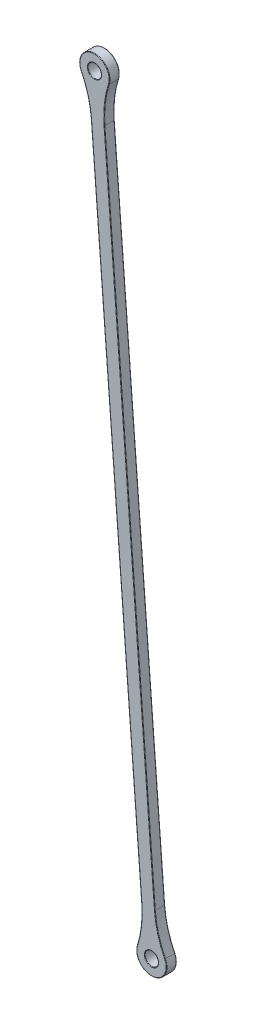
ISO-10303-21;
HEADER;
FILE_DESCRIPTION(('STEP AP214'),'2;1');
FILE_NAME('part.step','',(''),(''),'','','');
FILE_SCHEMA(('AUTOMOTIVE_DESIGN { 1 0 10303 214 1 1 1 1 }'));
ENDSEC;
DATA;
#1=APPLICATION_CONTEXT('core data for automotive mechanical design processes');
#2=APPLICATION_PROTOCOL_DEFINITION('international standard','automotive_design',2000,#1);
#3=PRODUCT_CONTEXT('',#1,'mechanical');
#4=PRODUCT('Part','Part','',(#3));
#5=PRODUCT_RELATED_PRODUCT_CATEGORY('part','',(#4));
#6=PRODUCT_DEFINITION_FORMATION('','',#4);
#7=PRODUCT_DEFINITION_CONTEXT('part definition',#1,'design');
#8=PRODUCT_DEFINITION('design','',#6,#7);
#9=PRODUCT_DEFINITION_SHAPE('','',#8);
#10=(LENGTH_UNIT() NAMED_UNIT(*) SI_UNIT(.MILLI.,.METRE.));
#11=(NAMED_UNIT(*) PLANE_ANGLE_UNIT() SI_UNIT($,.RADIAN.));
#12=(NAMED_UNIT(*) SI_UNIT($,.STERADIAN.) SOLID_ANGLE_UNIT());
#13=UNCERTAINTY_MEASURE_WITH_UNIT(LENGTH_MEASURE(1.E-05),#10,'distance_accuracy_value','');
#14=(GEOMETRIC_REPRESENTATION_CONTEXT(3) GLOBAL_UNCERTAINTY_ASSIGNED_CONTEXT((#13)) GLOBAL_UNIT_ASSIGNED_CONTEXT((#10,
#11,#12)) REPRESENTATION_CONTEXT('',''));
#15=CARTESIAN_POINT('',(0.,0.,0.));
#16=DIRECTION('',(0.,0.,1.));
#17=DIRECTION('',(1.,0.,0.));
#18=AXIS2_PLACEMENT_3D('',#15,#16,#17);
#19=CARTESIAN_POINT('',(22.6475823836566,1.74399123036091,-3.));
#20=DIRECTION('',(-0.99704818829738,-0.0767783186382262,0.));
#21=DIRECTION('',(0.0767783186382262,-0.99704818829738,0.));
#22=AXIS2_PLACEMENT_3D('',#19,#20,#21);
#23=PLANE('',#22);
#24=DIRECTION('',(0.,0.,-1.));
#25=VECTOR('',#24,1.);
#26=CARTESIAN_POINT('',(15.5041323252794,94.5092935347507,-3.));
#27=LINE('',#26,#25);
#28=CARTESIAN_POINT('',(15.5041323252794,94.5092935347507,-0.15));
#29=VERTEX_POINT('',#28);
#30=CARTESIAN_POINT('',(15.5041323252794,94.5092935347507,-2.85));
#31=VERTEX_POINT('',#30);
#32=EDGE_CURVE('E310',#29,#31,#27,.T.);
#33=ORIENTED_EDGE('',*,*,#32,.T.);
#34=DIRECTION('',(0.0767783186382262,-0.99704818829738,0.));
#35=VECTOR('',#34,1.);
#36=CARTESIAN_POINT('',(22.6475823836566,1.74399123036091,-2.85));
#37=LINE('',#36,#35);
#38=CARTESIAN_POINT('',(0.439273690223931,290.142517541819,-2.85));
#39=VERTEX_POINT('',#38);
#40=EDGE_CURVE('E219',#31,#39,#37,.F.);
#41=ORIENTED_EDGE('',*,*,#40,.T.);
#42=DIRECTION('',(0.,0.,1.));
#43=VECTOR('',#42,1.);
#44=CARTESIAN_POINT('',(0.439273690223931,290.142517541819,-3.));
#45=LINE('',#44,#43);
#46=CARTESIAN_POINT('',(0.439273690223931,290.142517541819,-0.15));
#47=VERTEX_POINT('',#46);
#48=EDGE_CURVE('E346',#39,#47,#45,.T.);
#49=ORIENTED_EDGE('',*,*,#48,.T.);
#50=DIRECTION('',(0.0767783186382262,-0.99704818829738,0.));
#51=VECTOR('',#50,1.);
#52=CARTESIAN_POINT('',(15.5041323252794,94.5092935347507,-0.15));
#53=LINE('',#52,#51);
#54=EDGE_CURVE('E217',#47,#29,#53,.T.);
#55=ORIENTED_EDGE('',*,*,#54,.T.);
#56=EDGE_LOOP('',(#33,#41,#49,#55));
#57=FACE_BOUND('',#56,.T.);
#58=ADVANCED_FACE('F39',(#57),#23,.F.);
#59=CARTESIAN_POINT('',(14.5,81.4999999999992,-3.));
#60=DIRECTION('',(0.,0.,1.));
#61=DIRECTION('',(1.,0.,0.));
#62=AXIS2_PLACEMENT_3D('',#59,#60,#61);
#63=CYLINDRICAL_SURFACE('',#62,4.50000000000001);
#64=DIRECTION('',(0.,0.,1.));
#65=VECTOR('',#64,1.);
#66=CARTESIAN_POINT('',(10.2092818160654,82.8563692218755,-3.));
#67=LINE('',#66,#65);
#68=CARTESIAN_POINT('',(10.2092818160654,82.8563692218755,-0.15));
#69=VERTEX_POINT('',#68);
#70=CARTESIAN_POINT('',(10.2092818160654,82.8563692218755,-2.85));
#71=VERTEX_POINT('',#70);
#72=EDGE_CURVE('E343',#69,#71,#67,.F.);
#73=ORIENTED_EDGE('',*,*,#72,.T.);
#74=CARTESIAN_POINT('',(14.5,81.4999999999992,-2.85));
#75=DIRECTION('',(0.,0.,1.));
#76=DIRECTION('',(1.,0.,0.));
#77=AXIS2_PLACEMENT_3D('',#74,#75,#76);
#78=CIRCLE('',#77,4.50000000000001);
#79=CARTESIAN_POINT('',(18.532466692287,83.4973012731163,-2.85));
#80=VERTEX_POINT('',#79);
#81=EDGE_CURVE('E210',#71,#80,#78,.T.);
#82=ORIENTED_EDGE('',*,*,#81,.T.);
#83=DIRECTION('',(0.,0.,1.));
#84=VECTOR('',#83,1.);
#85=CARTESIAN_POINT('',(18.532466692287,83.4973012731163,-3.));
#86=LINE('',#85,#84);
#87=CARTESIAN_POINT('',(18.532466692287,83.4973012731163,-0.15));
#88=VERTEX_POINT('',#87);
#89=EDGE_CURVE('E338',#80,#88,#86,.T.);
#90=ORIENTED_EDGE('',*,*,#89,.T.);
#91=CARTESIAN_POINT('',(14.5,81.4999999999992,-0.15));
#92=DIRECTION('',(0.,0.,1.));
#93=DIRECTION('',(1.,0.,0.));
#94=AXIS2_PLACEMENT_3D('',#91,#92,#93);
#95=CIRCLE('',#94,4.50000000000001);
#96=EDGE_CURVE('E208',#88,#69,#95,.F.);
#97=ORIENTED_EDGE('',*,*,#96,.T.);
#98=EDGE_LOOP('',(#73,#82,#90,#97));
#99=FACE_BOUND('',#98,.T.);
#100=ADVANCED_FACE('F388',(#99),#63,.T.);
#101=CARTESIAN_POINT('',(18.659389630467,1.436877955808,-3.));
#102=DIRECTION('',(-0.99704818829738,-0.0767783186382261,0.));
#103=DIRECTION('',(0.0767783186382261,-0.99704818829738,0.));
#104=AXIS2_PLACEMENT_3D('',#101,#102,#103);
#105=PLANE('',#104);
#106=DIRECTION('',(0.,0.,-1.));
#107=VECTOR('',#106,1.);
#108=CARTESIAN_POINT('',(-3.54891906296558,289.835404267266,-3.));
#109=LINE('',#108,#107);
#110=CARTESIAN_POINT('',(-3.54891906296558,289.835404267266,-0.15));
#111=VERTEX_POINT('',#110);
#112=CARTESIAN_POINT('',(-3.54891906296558,289.835404267266,-2.85));
#113=VERTEX_POINT('',#112);
#114=EDGE_CURVE('E262',#111,#113,#109,.T.);
#115=ORIENTED_EDGE('',*,*,#114,.T.);
#116=DIRECTION('',(0.0767783186382261,-0.99704818829738,0.));
#117=VECTOR('',#116,1.);
#118=CARTESIAN_POINT('',(11.5159395720898,94.202180260198,-2.85));
#119=LINE('',#118,#117);
#120=CARTESIAN_POINT('',(11.5159395720898,94.202180260198,-2.85));
#121=VERTEX_POINT('',#120);
#122=EDGE_CURVE('E202',#113,#121,#119,.T.);
#123=ORIENTED_EDGE('',*,*,#122,.T.);
#124=DIRECTION('',(0.,0.,1.));
#125=VECTOR('',#124,1.);
#126=CARTESIAN_POINT('',(11.5159395720898,94.202180260198,-3.));
#127=LINE('',#126,#125);
#128=CARTESIAN_POINT('',(11.5159395720898,94.202180260198,-0.15));
#129=VERTEX_POINT('',#128);
#130=EDGE_CURVE('E336',#121,#129,#127,.T.);
#131=ORIENTED_EDGE('',*,*,#130,.T.);
#132=DIRECTION('',(0.0767783186382261,-0.99704818829738,0.));
#133=VECTOR('',#132,1.);
#134=CARTESIAN_POINT('',(18.659389630467,1.436877955808,-0.15));
#135=LINE('',#134,#133);
#136=EDGE_CURVE('E200',#129,#111,#135,.F.);
#137=ORIENTED_EDGE('',*,*,#136,.T.);
#138=EDGE_LOOP('',(#115,#123,#131,#137));
#139=FACE_BOUND('',#138,.T.);
#140=ADVANCED_FACE('F335',(#139),#105,.T.);
#141=CARTESIAN_POINT('',(14.5,81.4999999999992,-3.));
#142=DIRECTION('',(0.,0.,1.));
#143=DIRECTION('',(1.,0.,0.));
#144=AXIS2_PLACEMENT_3D('',#141,#142,#143);
#145=CYLINDRICAL_SURFACE('',#144,2.00000000000001);
#146=CARTESIAN_POINT('',(14.5,81.4999999999992,-2.85));
#147=DIRECTION('',(0.,0.,1.));
#148=DIRECTION('',(1.,0.,0.));
#149=AXIS2_PLACEMENT_3D('',#146,#147,#148);
#150=CIRCLE('',#149,2.00000000000001);
#151=CARTESIAN_POINT('',(16.5,81.4999999999992,-2.85));
#152=VERTEX_POINT('',#151);
#153=EDGE_CURVE('E194',#152,#152,#150,.F.);
#154=ORIENTED_EDGE('',*,*,#153,.T.);
#155=EDGE_LOOP('',(#154));
#156=FACE_BOUND('',#155,.T.);
#157=CARTESIAN_POINT('',(14.5,81.4999999999992,-0.15));
#158=DIRECTION('',(0.,0.,1.));
#159=DIRECTION('',(1.,0.,0.));
#160=AXIS2_PLACEMENT_3D('',#157,#158,#159);
#161=CIRCLE('',#160,2.00000000000001);
#162=CARTESIAN_POINT('',(16.5,81.4999999999992,-0.15));
#163=VERTEX_POINT('',#162);
#164=EDGE_CURVE('E191',#163,#163,#161,.T.);
#165=ORIENTED_EDGE('',*,*,#164,.T.);
#166=EDGE_LOOP('',(#165));
#167=FACE_BOUND('',#166,.T.);
#168=ADVANCED_FACE('F640',(#156,#167),#145,.F.);
#169=CARTESIAN_POINT('',(-2.54478673768622,302.844697802017,-3.));
#170=DIRECTION('',(0.,0.,1.));
#171=DIRECTION('',(1.,0.,0.));
#172=AXIS2_PLACEMENT_3D('',#169,#170,#171);
#173=CYLINDRICAL_SURFACE('',#172,4.5);
#174=DIRECTION('',(0.,0.,1.));
#175=VECTOR('',#174,1.);
#176=CARTESIAN_POINT('',(1.74593144624834,301.488328580141,-3.));
#177=LINE('',#176,#175);
#178=CARTESIAN_POINT('',(1.74593144624834,301.488328580141,-0.15));
#179=VERTEX_POINT('',#178);
#180=CARTESIAN_POINT('',(1.74593144624834,301.488328580141,-2.85));
#181=VERTEX_POINT('',#180);
#182=EDGE_CURVE('E306',#179,#181,#177,.F.);
#183=ORIENTED_EDGE('',*,*,#182,.T.);
#184=CARTESIAN_POINT('',(-2.54478673768622,302.844697802017,-2.85));
#185=DIRECTION('',(0.,0.,1.));
#186=DIRECTION('',(1.,0.,0.));
#187=AXIS2_PLACEMENT_3D('',#184,#185,#186);
#188=CIRCLE('',#187,4.5);
#189=CARTESIAN_POINT('',(-6.57725342997327,300.8473965289,-2.85));
#190=VERTEX_POINT('',#189);
#191=EDGE_CURVE('E227',#181,#190,#188,.T.);
#192=ORIENTED_EDGE('',*,*,#191,.T.);
#193=DIRECTION('',(0.,0.,1.));
#194=VECTOR('',#193,1.);
#195=CARTESIAN_POINT('',(-6.57725342997327,300.8473965289,-3.));
#196=LINE('',#195,#194);
#197=CARTESIAN_POINT('',(-6.57725342997327,300.8473965289,-0.15));
#198=VERTEX_POINT('',#197);
#199=EDGE_CURVE('E299',#190,#198,#196,.T.);
#200=ORIENTED_EDGE('',*,*,#199,.T.);
#201=CARTESIAN_POINT('',(-2.54478673768622,302.844697802017,-0.15));
#202=DIRECTION('',(0.,0.,1.));
#203=DIRECTION('',(1.,0.,0.));
#204=AXIS2_PLACEMENT_3D('',#201,#202,#203);
#205=CIRCLE('',#204,4.5);
#206=EDGE_CURVE('E225',#198,#179,#205,.F.);
#207=ORIENTED_EDGE('',*,*,#206,.T.);
#208=EDGE_LOOP('',(#183,#192,#200,#207));
#209=FACE_BOUND('',#208,.T.);
#210=ADVANCED_FACE('F303',(#209),#173,.T.);
#211=CARTESIAN_POINT('',(-2.54478673768622,302.844697802017,-3.));
#212=DIRECTION('',(0.,0.,1.));
#213=DIRECTION('',(1.,0.,0.));
#214=AXIS2_PLACEMENT_3D('',#211,#212,#213);
#215=CYLINDRICAL_SURFACE('',#214,2.);
#216=CARTESIAN_POINT('',(-2.54478673768622,302.844697802017,-2.85));
#217=DIRECTION('',(0.,0.,1.));
#218=DIRECTION('',(1.,0.,0.));
#219=AXIS2_PLACEMENT_3D('',#216,#217,#218);
#220=CIRCLE('',#219,2.);
#221=CARTESIAN_POINT('',(-0.544786737686224,302.844697802017,-2.85));
#222=VERTEX_POINT('',#221);
#223=EDGE_CURVE('E174',#222,#222,#220,.F.);
#224=ORIENTED_EDGE('',*,*,#223,.T.);
#225=EDGE_LOOP('',(#224));
#226=FACE_BOUND('',#225,.T.);
#227=CARTESIAN_POINT('',(-2.54478673768622,302.844697802017,-0.15));
#228=DIRECTION('',(0.,0.,1.));
#229=DIRECTION('',(1.,0.,0.));
#230=AXIS2_PLACEMENT_3D('',#227,#228,#229);
#231=CIRCLE('',#230,2.);
#232=CARTESIAN_POINT('',(-0.544786737686224,302.844697802017,-0.15));
#233=VERTEX_POINT('',#232);
#234=EDGE_CURVE('E305',#233,#233,#231,.T.);
#235=ORIENTED_EDGE('',*,*,#234,.T.);
#236=EDGE_LOOP('',(#235));
#237=FACE_BOUND('',#236,.T.);
#238=ADVANCED_FACE('F618',(#226,#237),#215,.F.);
#239=CARTESIAN_POINT('',(0.,0.,-3.));
#240=DIRECTION('',(0.,0.,1.));
#241=DIRECTION('',(1.,0.,0.));
#242=AXIS2_PLACEMENT_3D('',#239,#240,#241);
#243=PLANE('',#242);
#244=CARTESIAN_POINT('',(-2.54478673768622,302.844697802017,-3.));
#245=DIRECTION('',(0.,0.,1.));
#246=DIRECTION('',(1.,0.,0.));
#247=AXIS2_PLACEMENT_3D('',#244,#245,#246);
#248=CIRCLE('',#247,2.15);
#249=CARTESIAN_POINT('',(-0.394786737686224,302.844697802017,-3.));
#250=VERTEX_POINT('',#249);
#251=EDGE_CURVE('E183',#250,#250,#248,.T.);
#252=ORIENTED_EDGE('',*,*,#251,.T.);
#253=EDGE_LOOP('',(#252));
#254=FACE_BOUND('',#253,.T.);
#255=CARTESIAN_POINT('',(14.5,81.4999999999992,-3.));
#256=DIRECTION('',(0.,0.,1.));
#257=DIRECTION('',(1.,0.,0.));
#258=AXIS2_PLACEMENT_3D('',#255,#256,#257);
#259=CIRCLE('',#258,2.15000000000001);
#260=CARTESIAN_POINT('',(16.65,81.4999999999992,-3.));
#261=VERTEX_POINT('',#260);
#262=EDGE_CURVE('E180',#261,#261,#259,.T.);
#263=ORIENTED_EDGE('',*,*,#262,.T.);
#264=EDGE_LOOP('',(#263));
#265=FACE_BOUND('',#264,.T.);
#266=DIRECTION('',(0.0767783186382261,-0.99704818829738,0.));
#267=VECTOR('',#266,1.);
#268=CARTESIAN_POINT('',(-3.39936183472098,289.846921015062,-3.));
#269=LINE('',#268,#267);
#270=CARTESIAN_POINT('',(11.6654968003344,94.2136970079937,-3.));
#271=VERTEX_POINT('',#270);
#272=CARTESIAN_POINT('',(-3.39936183472098,289.846921015062,-3.));
#273=VERTEX_POINT('',#272);
#274=EDGE_CURVE('E178',#271,#273,#269,.F.);
#275=ORIENTED_EDGE('',*,*,#274,.T.);
#276=CARTESIAN_POINT('',(-33.460364711887,287.532054708119,-3.));
#277=DIRECTION('',(0.,0.,1.));
#278=DIRECTION('',(1.,0.,0.));
#279=AXIS2_PLACEMENT_3D('',#276,#277,#278);
#280=CIRCLE('',#279,30.15);
#281=CARTESIAN_POINT('',(-6.44283787356371,300.913973238004,-3.));
#282=VERTEX_POINT('',#281);
#283=EDGE_CURVE('E159',#273,#282,#280,.T.);
#284=ORIENTED_EDGE('',*,*,#283,.T.);
#285=CARTESIAN_POINT('',(-2.54478673768622,302.844697802017,-3.));
#286=DIRECTION('',(0.,0.,1.));
#287=DIRECTION('',(1.,0.,0.));
#288=AXIS2_PLACEMENT_3D('',#285,#286,#287);
#289=CIRCLE('',#288,4.35);
#290=CARTESIAN_POINT('',(1.60290750678386,301.533540887537,-3.));
#291=VERTEX_POINT('',#290);
#292=EDGE_CURVE('E167',#282,#291,#289,.F.);
#293=ORIENTED_EDGE('',*,*,#292,.T.);
#294=CARTESIAN_POINT('',(30.3507193391453,292.445867100966,-3.));
#295=DIRECTION('',(0.,0.,1.));
#296=DIRECTION('',(1.,0.,0.));
#297=AXIS2_PLACEMENT_3D('',#294,#295,#296);
#298=CIRCLE('',#297,30.15);
#299=CARTESIAN_POINT('',(0.289716461979317,290.131000794023,-3.));
#300=VERTEX_POINT('',#299);
#301=EDGE_CURVE('E173',#291,#300,#298,.T.);
#302=ORIENTED_EDGE('',*,*,#301,.T.);
#303=DIRECTION('',(0.0767783186382262,-0.99704818829738,0.));
#304=VECTOR('',#303,1.);
#305=CARTESIAN_POINT('',(22.498025155412,1.73247448256518,-3.));
#306=LINE('',#305,#304);
#307=CARTESIAN_POINT('',(15.3545750970348,94.497776786955,-3.));
#308=VERTEX_POINT('',#307);
#309=EDGE_CURVE('E317',#300,#308,#306,.T.);
#310=ORIENTED_EDGE('',*,*,#309,.T.);
#311=CARTESIAN_POINT('',(45.4155779742007,96.8126430938975,-3.));
#312=DIRECTION('',(0.,0.,1.));
#313=DIRECTION('',(1.,0.,0.));
#314=AXIS2_PLACEMENT_3D('',#311,#312,#313);
#315=CIRCLE('',#314,30.15);
#316=CARTESIAN_POINT('',(18.3980511358775,83.4307245640125,-3.));
#317=VERTEX_POINT('',#316);
#318=EDGE_CURVE('E319',#308,#317,#315,.T.);
#319=ORIENTED_EDGE('',*,*,#318,.T.);
#320=CARTESIAN_POINT('',(14.5,81.4999999999992,-3.));
#321=DIRECTION('',(0.,0.,1.));
#322=DIRECTION('',(1.,0.,0.));
#323=AXIS2_PLACEMENT_3D('',#320,#321,#322);
#324=CIRCLE('',#323,4.35000000000001);
#325=CARTESIAN_POINT('',(10.3523057555299,82.8111569144797,-3.));
#326=VERTEX_POINT('',#325);
#327=EDGE_CURVE('E321',#317,#326,#324,.F.);
#328=ORIENTED_EDGE('',*,*,#327,.T.);
#329=CARTESIAN_POINT('',(-18.3955060768316,91.8988307010512,-3.));
#330=DIRECTION('',(0.,0.,1.));
#331=DIRECTION('',(1.,0.,0.));
#332=AXIS2_PLACEMENT_3D('',#329,#330,#331);
#333=CIRCLE('',#332,30.15);
#334=EDGE_CURVE('E185',#326,#271,#333,.T.);
#335=ORIENTED_EDGE('',*,*,#334,.T.);
#336=EDGE_LOOP('',(#275,#284,#293,#302,#310,#319,#328,#335));
#337=FACE_BOUND('',#336,.T.);
#338=ADVANCED_FACE('F176',(#254,#265,#337),#243,.F.);
#339=CARTESIAN_POINT('',(0.,0.,0.));
#340=DIRECTION('',(0.,0.,1.));
#341=DIRECTION('',(1.,0.,0.));
#342=AXIS2_PLACEMENT_3D('',#339,#340,#341);
#343=PLANE('',#342);
#344=CARTESIAN_POINT('',(-2.54478673768622,302.844697802017,0.));
#345=DIRECTION('',(0.,0.,1.));
#346=DIRECTION('',(1.,0.,0.));
#347=AXIS2_PLACEMENT_3D('',#344,#345,#346);
#348=CIRCLE('',#347,2.15);
#349=CARTESIAN_POINT('',(-0.394786737686224,302.844697802017,0.));
#350=VERTEX_POINT('',#349);
#351=EDGE_CURVE('E11',#350,#350,#348,.F.);
#352=ORIENTED_EDGE('',*,*,#351,.T.);
#353=EDGE_LOOP('',(#352));
#354=FACE_BOUND('',#353,.T.);
#355=CARTESIAN_POINT('',(14.5,81.4999999999992,0.));
#356=DIRECTION('',(0.,0.,1.));
#357=DIRECTION('',(1.,0.,0.));
#358=AXIS2_PLACEMENT_3D('',#355,#356,#357);
#359=CIRCLE('',#358,2.15000000000001);
#360=CARTESIAN_POINT('',(16.65,81.4999999999992,0.));
#361=VERTEX_POINT('',#360);
#362=EDGE_CURVE('E48',#361,#361,#359,.F.);
#363=ORIENTED_EDGE('',*,*,#362,.T.);
#364=EDGE_LOOP('',(#363));
#365=FACE_BOUND('',#364,.T.);
#366=CARTESIAN_POINT('',(14.5,81.4999999999992,0.));
#367=DIRECTION('',(0.,0.,1.));
#368=DIRECTION('',(1.,0.,0.));
#369=AXIS2_PLACEMENT_3D('',#366,#367,#368);
#370=CIRCLE('',#369,4.35000000000001);
#371=CARTESIAN_POINT('',(10.3523057555299,82.8111569144797,0.));
#372=VERTEX_POINT('',#371);
#373=CARTESIAN_POINT('',(18.3980511358775,83.4307245640125,0.));
#374=VERTEX_POINT('',#373);
#375=EDGE_CURVE('E56',#372,#374,#370,.T.);
#376=ORIENTED_EDGE('',*,*,#375,.T.);
#377=CARTESIAN_POINT('',(45.4155779742007,96.8126430938975,0.));
#378=DIRECTION('',(0.,0.,1.));
#379=DIRECTION('',(1.,0.,0.));
#380=AXIS2_PLACEMENT_3D('',#377,#378,#379);
#381=CIRCLE('',#380,30.15);
#382=CARTESIAN_POINT('',(15.3545750970348,94.497776786955,0.));
#383=VERTEX_POINT('',#382);
#384=EDGE_CURVE('E241',#374,#383,#381,.F.);
#385=ORIENTED_EDGE('',*,*,#384,.T.);
#386=DIRECTION('',(0.0767783186382262,-0.99704818829738,0.));
#387=VECTOR('',#386,1.);
#388=CARTESIAN_POINT('',(0.289716461979322,290.131000794023,0.));
#389=LINE('',#388,#387);
#390=CARTESIAN_POINT('',(0.28971646197933,290.131000794023,0.));
#391=VERTEX_POINT('',#390);
#392=EDGE_CURVE('E229',#383,#391,#389,.F.);
#393=ORIENTED_EDGE('',*,*,#392,.T.);
#394=CARTESIAN_POINT('',(30.3507193391453,292.445867100966,0.));
#395=DIRECTION('',(0.,0.,1.));
#396=DIRECTION('',(1.,0.,0.));
#397=AXIS2_PLACEMENT_3D('',#394,#395,#396);
#398=CIRCLE('',#397,30.15);
#399=CARTESIAN_POINT('',(1.60290750678386,301.533540887537,0.));
#400=VERTEX_POINT('',#399);
#401=EDGE_CURVE('E231',#391,#400,#398,.F.);
#402=ORIENTED_EDGE('',*,*,#401,.T.);
#403=CARTESIAN_POINT('',(-2.54478673768622,302.844697802017,0.));
#404=DIRECTION('',(0.,0.,1.));
#405=DIRECTION('',(1.,0.,0.));
#406=AXIS2_PLACEMENT_3D('',#403,#404,#405);
#407=CIRCLE('',#406,4.35);
#408=CARTESIAN_POINT('',(-6.44283787356371,300.913973238004,0.));
#409=VERTEX_POINT('',#408);
#410=EDGE_CURVE('E233',#400,#409,#407,.T.);
#411=ORIENTED_EDGE('',*,*,#410,.T.);
#412=CARTESIAN_POINT('',(-33.460364711887,287.532054708119,0.));
#413=DIRECTION('',(0.,0.,1.));
#414=DIRECTION('',(1.,0.,0.));
#415=AXIS2_PLACEMENT_3D('',#412,#413,#414);
#416=CIRCLE('',#415,30.15);
#417=CARTESIAN_POINT('',(-3.39936183472098,289.846921015062,0.));
#418=VERTEX_POINT('',#417);
#419=EDGE_CURVE('E235',#409,#418,#416,.F.);
#420=ORIENTED_EDGE('',*,*,#419,.T.);
#421=DIRECTION('',(0.0767783186382261,-0.99704818829738,0.));
#422=VECTOR('',#421,1.);
#423=CARTESIAN_POINT('',(18.8089468587116,1.44839470360373,0.));
#424=LINE('',#423,#422);
#425=CARTESIAN_POINT('',(11.6654968003344,94.2136970079937,0.));
#426=VERTEX_POINT('',#425);
#427=EDGE_CURVE('E237',#418,#426,#424,.T.);
#428=ORIENTED_EDGE('',*,*,#427,.T.);
#429=CARTESIAN_POINT('',(-18.3955060768316,91.8988307010512,0.));
#430=DIRECTION('',(0.,0.,1.));
#431=DIRECTION('',(1.,0.,0.));
#432=AXIS2_PLACEMENT_3D('',#429,#430,#431);
#433=CIRCLE('',#432,30.15);
#434=EDGE_CURVE('E61',#426,#372,#433,.F.);
#435=ORIENTED_EDGE('',*,*,#434,.T.);
#436=EDGE_LOOP('',(#376,#385,#393,#402,#411,#420,#428,#435));
#437=FACE_BOUND('',#436,.T.);
#438=ADVANCED_FACE('F414',(#354,#365,#437),#343,.T.);
#439=CARTESIAN_POINT('',(-18.3955060768316,91.8988307010512,-3.));
#440=DIRECTION('',(0.,0.,1.));
#441=DIRECTION('',(1.,0.,0.));
#442=AXIS2_PLACEMENT_3D('',#439,#440,#441);
#443=CYLINDRICAL_SURFACE('',#442,30.);
#444=ORIENTED_EDGE('',*,*,#130,.F.);
#445=CARTESIAN_POINT('',(-18.3955060768316,91.8988307010512,-2.85));
#446=DIRECTION('',(0.,0.,1.));
#447=DIRECTION('',(1.,0.,0.));
#448=AXIS2_PLACEMENT_3D('',#445,#446,#447);
#449=CIRCLE('',#448,30.);
#450=EDGE_CURVE('E206',#121,#71,#449,.F.);
#451=ORIENTED_EDGE('',*,*,#450,.T.);
#452=ORIENTED_EDGE('',*,*,#72,.F.);
#453=CARTESIAN_POINT('',(-18.3955060768316,91.8988307010512,-0.15));
#454=DIRECTION('',(0.,0.,1.));
#455=DIRECTION('',(1.,0.,0.));
#456=AXIS2_PLACEMENT_3D('',#453,#454,#455);
#457=CIRCLE('',#456,30.);
#458=EDGE_CURVE('E204',#69,#129,#457,.T.);
#459=ORIENTED_EDGE('',*,*,#458,.T.);
#460=EDGE_LOOP('',(#444,#451,#452,#459));
#461=FACE_BOUND('',#460,.T.);
#462=ADVANCED_FACE('F411',(#461),#443,.F.);
#463=CARTESIAN_POINT('',(45.4155779742007,96.8126430938975,-3.));
#464=DIRECTION('',(0.,0.,1.));
#465=DIRECTION('',(1.,0.,0.));
#466=AXIS2_PLACEMENT_3D('',#463,#464,#465);
#467=CYLINDRICAL_SURFACE('',#466,30.);
#468=ORIENTED_EDGE('',*,*,#89,.F.);
#469=CARTESIAN_POINT('',(45.4155779742007,96.8126430938975,-2.85));
#470=DIRECTION('',(0.,0.,1.));
#471=DIRECTION('',(1.,0.,0.));
#472=AXIS2_PLACEMENT_3D('',#469,#470,#471);
#473=CIRCLE('',#472,30.);
#474=EDGE_CURVE('E215',#80,#31,#473,.F.);
#475=ORIENTED_EDGE('',*,*,#474,.T.);
#476=ORIENTED_EDGE('',*,*,#32,.F.);
#477=CARTESIAN_POINT('',(45.4155779742007,96.8126430938975,-0.15));
#478=DIRECTION('',(0.,0.,1.));
#479=DIRECTION('',(1.,0.,0.));
#480=AXIS2_PLACEMENT_3D('',#477,#478,#479);
#481=CIRCLE('',#480,30.);
#482=EDGE_CURVE('E212',#29,#88,#481,.T.);
#483=ORIENTED_EDGE('',*,*,#482,.T.);
#484=EDGE_LOOP('',(#468,#475,#476,#483));
#485=FACE_BOUND('',#484,.T.);
#486=ADVANCED_FACE('F386',(#485),#467,.F.);
#487=CARTESIAN_POINT('',(-33.460364711887,287.532054708119,-3.));
#488=DIRECTION('',(0.,0.,1.));
#489=DIRECTION('',(1.,0.,0.));
#490=AXIS2_PLACEMENT_3D('',#487,#488,#489);
#491=CYLINDRICAL_SURFACE('',#490,30.);
#492=ORIENTED_EDGE('',*,*,#199,.F.);
#493=CARTESIAN_POINT('',(-33.460364711887,287.532054708119,-2.85));
#494=DIRECTION('',(0.,0.,1.));
#495=DIRECTION('',(1.,0.,0.));
#496=AXIS2_PLACEMENT_3D('',#493,#494,#495);
#497=CIRCLE('',#496,30.);
#498=EDGE_CURVE('E161',#190,#113,#497,.F.);
#499=ORIENTED_EDGE('',*,*,#498,.T.);
#500=ORIENTED_EDGE('',*,*,#114,.F.);
#501=CARTESIAN_POINT('',(-33.460364711887,287.532054708119,-0.15));
#502=DIRECTION('',(0.,0.,1.));
#503=DIRECTION('',(1.,0.,0.));
#504=AXIS2_PLACEMENT_3D('',#501,#502,#503);
#505=CIRCLE('',#504,30.);
#506=EDGE_CURVE('E197',#111,#198,#505,.T.);
#507=ORIENTED_EDGE('',*,*,#506,.T.);
#508=EDGE_LOOP('',(#492,#499,#500,#507));
#509=FACE_BOUND('',#508,.T.);
#510=ADVANCED_FACE('F298',(#509),#491,.F.);
#511=CARTESIAN_POINT('',(30.3507193391453,292.445867100966,-3.));
#512=DIRECTION('',(0.,0.,1.));
#513=DIRECTION('',(1.,0.,0.));
#514=AXIS2_PLACEMENT_3D('',#511,#512,#513);
#515=CYLINDRICAL_SURFACE('',#514,30.);
#516=ORIENTED_EDGE('',*,*,#48,.F.);
#517=CARTESIAN_POINT('',(30.3507193391453,292.445867100966,-2.85));
#518=DIRECTION('',(0.,0.,1.));
#519=DIRECTION('',(1.,0.,0.));
#520=AXIS2_PLACEMENT_3D('',#517,#518,#519);
#521=CIRCLE('',#520,30.);
#522=EDGE_CURVE('E223',#39,#181,#521,.F.);
#523=ORIENTED_EDGE('',*,*,#522,.T.);
#524=ORIENTED_EDGE('',*,*,#182,.F.);
#525=CARTESIAN_POINT('',(30.3507193391453,292.445867100966,-0.15));
#526=DIRECTION('',(0.,0.,1.));
#527=DIRECTION('',(1.,0.,0.));
#528=AXIS2_PLACEMENT_3D('',#525,#526,#527);
#529=CIRCLE('',#528,30.);
#530=EDGE_CURVE('E221',#179,#47,#529,.T.);
#531=ORIENTED_EDGE('',*,*,#530,.T.);
#532=EDGE_LOOP('',(#516,#523,#524,#531));
#533=FACE_BOUND('',#532,.T.);
#534=ADVANCED_FACE('F370',(#533),#515,.F.);
#535=CARTESIAN_POINT('',(-2.54478673768622,302.844697802017,-2.85));
#536=DIRECTION('',(0.,0.,1.));
#537=DIRECTION('',(1.,0.,0.));
#538=AXIS2_PLACEMENT_3D('',#535,#536,#537);
#539=TOROIDAL_SURFACE('',#538,2.15,0.15);
#540=ORIENTED_EDGE('',*,*,#251,.F.);
#541=EDGE_LOOP('',(#540));
#542=FACE_BOUND('',#541,.T.);
#543=ORIENTED_EDGE('',*,*,#223,.F.);
#544=EDGE_LOOP('',(#543));
#545=FACE_BOUND('',#544,.T.);
#546=ADVANCED_FACE('F422',(#542,#545),#539,.T.);
#547=CARTESIAN_POINT('',(14.5,81.4999999999992,-2.85));
#548=DIRECTION('',(0.,0.,1.));
#549=DIRECTION('',(1.,0.,0.));
#550=AXIS2_PLACEMENT_3D('',#547,#548,#549);
#551=TOROIDAL_SURFACE('',#550,2.15000000000001,0.15);
#552=ORIENTED_EDGE('',*,*,#153,.F.);
#553=EDGE_LOOP('',(#552));
#554=FACE_BOUND('',#553,.T.);
#555=ORIENTED_EDGE('',*,*,#262,.F.);
#556=EDGE_LOOP('',(#555));
#557=FACE_BOUND('',#556,.T.);
#558=ADVANCED_FACE('F400',(#554,#557),#551,.T.);
#559=CARTESIAN_POINT('',(45.4155779742007,96.8126430938975,-2.85));
#560=DIRECTION('',(0.,0.,1.));
#561=DIRECTION('',(1.,0.,0.));
#562=AXIS2_PLACEMENT_3D('',#559,#560,#561);
#563=TOROIDAL_SURFACE('',#562,30.15,0.15);
#564=CARTESIAN_POINT('',(15.3545750970347,94.497776786955,-2.85));
#565=DIRECTION('',(-0.076778318638208,0.997048188297381,0.));
#566=DIRECTION('',(-0.997048188297381,-0.076778318638208,0.));
#567=AXIS2_PLACEMENT_3D('',#564,#565,#566);
#568=CIRCLE('',#567,0.15);
#569=EDGE_CURVE('E256',#31,#308,#568,.T.);
#570=ORIENTED_EDGE('',*,*,#569,.F.);
#571=ORIENTED_EDGE('',*,*,#474,.F.);
#572=CARTESIAN_POINT('',(18.3980511358775,83.4307245640125,-2.85));
#573=DIRECTION('',(0.443844727359334,-0.896103709397143,0.));
#574=DIRECTION('',(0.896103709397143,0.443844727359334,0.));
#575=AXIS2_PLACEMENT_3D('',#572,#573,#574);
#576=CIRCLE('',#575,0.15);
#577=EDGE_CURVE('E259',#317,#80,#576,.T.);
#578=ORIENTED_EDGE('',*,*,#577,.F.);
#579=ORIENTED_EDGE('',*,*,#318,.F.);
#580=EDGE_LOOP('',(#570,#571,#578,#579));
#581=FACE_BOUND('',#580,.T.);
#582=ADVANCED_FACE('F360',(#581),#563,.T.);
#583=CARTESIAN_POINT('',(14.5,81.4999999999992,-2.85));
#584=DIRECTION('',(0.,0.,1.));
#585=DIRECTION('',(1.,0.,0.));
#586=AXIS2_PLACEMENT_3D('',#583,#584,#585);
#587=TOROIDAL_SURFACE('',#586,4.35000000000001,0.15);
#588=ORIENTED_EDGE('',*,*,#577,.T.);
#589=ORIENTED_EDGE('',*,*,#81,.F.);
#590=CARTESIAN_POINT('',(10.3523057555299,82.8111569144797,-2.85));
#591=DIRECTION('',(0.301415382639169,0.953492929763238,0.));
#592=DIRECTION('',(-0.953492929763238,0.301415382639169,0.));
#593=AXIS2_PLACEMENT_3D('',#590,#591,#592);
#594=CIRCLE('',#593,0.15);
#595=EDGE_CURVE('E253',#326,#71,#594,.T.);
#596=ORIENTED_EDGE('',*,*,#595,.F.);
#597=ORIENTED_EDGE('',*,*,#327,.F.);
#598=EDGE_LOOP('',(#588,#589,#596,#597));
#599=FACE_BOUND('',#598,.T.);
#600=ADVANCED_FACE('F392',(#599),#587,.T.);
#601=CARTESIAN_POINT('',(22.498025155412,1.73247448256518,-2.85));
#602=DIRECTION('',(0.0767783186382262,-0.99704818829738,0.));
#603=DIRECTION('',(0.99704818829738,0.0767783186382262,0.));
#604=AXIS2_PLACEMENT_3D('',#601,#602,#603);
#605=CYLINDRICAL_SURFACE('',#604,0.15);
#606=ORIENTED_EDGE('',*,*,#569,.T.);
#607=ORIENTED_EDGE('',*,*,#309,.F.);
#608=CARTESIAN_POINT('',(0.289716461979324,290.131000794023,-2.85));
#609=DIRECTION('',(-0.076778318638392,0.997048188297367,0.));
#610=DIRECTION('',(-0.997048188297367,-0.076778318638392,0.));
#611=AXIS2_PLACEMENT_3D('',#608,#609,#610);
#612=CIRCLE('',#611,0.15);
#613=EDGE_CURVE('E250',#39,#300,#612,.T.);
#614=ORIENTED_EDGE('',*,*,#613,.F.);
#615=ORIENTED_EDGE('',*,*,#40,.F.);
#616=EDGE_LOOP('',(#606,#607,#614,#615));
#617=FACE_BOUND('',#616,.T.);
#618=ADVANCED_FACE('F365',(#617),#605,.T.);
#619=CARTESIAN_POINT('',(-18.3955060768316,91.8988307010512,-2.85));
#620=DIRECTION('',(0.,0.,1.));
#621=DIRECTION('',(1.,0.,0.));
#622=AXIS2_PLACEMENT_3D('',#619,#620,#621);
#623=TOROIDAL_SURFACE('',#622,30.15,0.15);
#624=ORIENTED_EDGE('',*,*,#595,.T.);
#625=ORIENTED_EDGE('',*,*,#450,.F.);
#626=CARTESIAN_POINT('',(11.6654968003344,94.2136970079937,-2.85));
#627=DIRECTION('',(-0.0767783186382063,0.997048188297381,0.));
#628=DIRECTION('',(-0.997048188297381,-0.0767783186382063,0.));
#629=AXIS2_PLACEMENT_3D('',#626,#627,#628);
#630=CIRCLE('',#629,0.15);
#631=EDGE_CURVE('E247',#271,#121,#630,.T.);
#632=ORIENTED_EDGE('',*,*,#631,.F.);
#633=ORIENTED_EDGE('',*,*,#334,.F.);
#634=EDGE_LOOP('',(#624,#625,#632,#633));
#635=FACE_BOUND('',#634,.T.);
#636=ADVANCED_FACE('F328',(#635),#623,.T.);
#637=CARTESIAN_POINT('',(30.3507193391453,292.445867100966,-2.85));
#638=DIRECTION('',(0.,0.,1.));
#639=DIRECTION('',(1.,0.,0.));
#640=AXIS2_PLACEMENT_3D('',#637,#638,#639);
#641=TOROIDAL_SURFACE('',#640,30.15,0.15);
#642=ORIENTED_EDGE('',*,*,#613,.T.);
#643=ORIENTED_EDGE('',*,*,#301,.F.);
#644=CARTESIAN_POINT('',(1.60290750678385,301.533540887537,-2.85));
#645=DIRECTION('',(0.301415382639339,0.953492929763184,0.));
#646=DIRECTION('',(-0.953492929763184,0.301415382639339,0.));
#647=AXIS2_PLACEMENT_3D('',#644,#645,#646);
#648=CIRCLE('',#647,0.15);
#649=EDGE_CURVE('E170',#181,#291,#648,.T.);
#650=ORIENTED_EDGE('',*,*,#649,.F.);
#651=ORIENTED_EDGE('',*,*,#522,.F.);
#652=EDGE_LOOP('',(#642,#643,#650,#651));
#653=FACE_BOUND('',#652,.T.);
#654=ADVANCED_FACE('F368',(#653),#641,.T.);
#655=CARTESIAN_POINT('',(18.8089468587116,1.44839470360374,-2.85));
#656=DIRECTION('',(-0.0767783186382261,0.99704818829738,0.));
#657=DIRECTION('',(-0.99704818829738,-0.0767783186382261,0.));
#658=AXIS2_PLACEMENT_3D('',#655,#656,#657);
#659=CYLINDRICAL_SURFACE('',#658,0.15);
#660=ORIENTED_EDGE('',*,*,#631,.T.);
#661=ORIENTED_EDGE('',*,*,#122,.F.);
#662=CARTESIAN_POINT('',(-3.39936183472098,289.846921015062,-2.85));
#663=DIRECTION('',(-0.0767783186383924,0.997048188297367,0.));
#664=DIRECTION('',(-0.997048188297367,-0.0767783186383924,0.));
#665=AXIS2_PLACEMENT_3D('',#662,#663,#664);
#666=CIRCLE('',#665,0.15);
#667=EDGE_CURVE('E164',#273,#113,#666,.T.);
#668=ORIENTED_EDGE('',*,*,#667,.F.);
#669=ORIENTED_EDGE('',*,*,#274,.F.);
#670=EDGE_LOOP('',(#660,#661,#668,#669));
#671=FACE_BOUND('',#670,.T.);
#672=ADVANCED_FACE('F331',(#671),#659,.T.);
#673=CARTESIAN_POINT('',(-2.54478673768622,302.844697802017,-2.85));
#674=DIRECTION('',(0.,0.,1.));
#675=DIRECTION('',(1.,0.,0.));
#676=AXIS2_PLACEMENT_3D('',#673,#674,#675);
#677=TOROIDAL_SURFACE('',#676,4.35,0.15);
#678=ORIENTED_EDGE('',*,*,#649,.T.);
#679=ORIENTED_EDGE('',*,*,#292,.F.);
#680=CARTESIAN_POINT('',(-6.4428378735637,300.913973238004,-2.85));
#681=DIRECTION('',(0.443844727359487,-0.896103709397067,0.));
#682=DIRECTION('',(0.896103709397067,0.443844727359487,0.));
#683=AXIS2_PLACEMENT_3D('',#680,#681,#682);
#684=CIRCLE('',#683,0.15);
#685=EDGE_CURVE('E155',#190,#282,#684,.T.);
#686=ORIENTED_EDGE('',*,*,#685,.F.);
#687=ORIENTED_EDGE('',*,*,#191,.F.);
#688=EDGE_LOOP('',(#678,#679,#686,#687));
#689=FACE_BOUND('',#688,.T.);
#690=ADVANCED_FACE('F168',(#689),#677,.T.);
#691=CARTESIAN_POINT('',(-33.460364711887,287.532054708119,-2.85));
#692=DIRECTION('',(0.,0.,1.));
#693=DIRECTION('',(1.,0.,0.));
#694=AXIS2_PLACEMENT_3D('',#691,#692,#693);
#695=TOROIDAL_SURFACE('',#694,30.15,0.15);
#696=ORIENTED_EDGE('',*,*,#667,.T.);
#697=ORIENTED_EDGE('',*,*,#498,.F.);
#698=ORIENTED_EDGE('',*,*,#685,.T.);
#699=ORIENTED_EDGE('',*,*,#283,.F.);
#700=EDGE_LOOP('',(#696,#697,#698,#699));
#701=FACE_BOUND('',#700,.T.);
#702=ADVANCED_FACE('F157',(#701),#695,.T.);
#703=CARTESIAN_POINT('',(-2.54478673768622,302.844697802017,-0.15));
#704=DIRECTION('',(0.,0.,1.));
#705=DIRECTION('',(1.,0.,0.));
#706=AXIS2_PLACEMENT_3D('',#703,#704,#705);
#707=TOROIDAL_SURFACE('',#706,2.15,0.15);
#708=ORIENTED_EDGE('',*,*,#234,.F.);
#709=EDGE_LOOP('',(#708));
#710=FACE_BOUND('',#709,.T.);
#711=ORIENTED_EDGE('',*,*,#351,.F.);
#712=EDGE_LOOP('',(#711));
#713=FACE_BOUND('',#712,.T.);
#714=ADVANCED_FACE('F431',(#710,#713),#707,.T.);
#715=CARTESIAN_POINT('',(14.5,81.4999999999992,-0.15));
#716=DIRECTION('',(0.,0.,1.));
#717=DIRECTION('',(1.,0.,0.));
#718=AXIS2_PLACEMENT_3D('',#715,#716,#717);
#719=TOROIDAL_SURFACE('',#718,2.15000000000001,0.15);
#720=ORIENTED_EDGE('',*,*,#362,.F.);
#721=EDGE_LOOP('',(#720));
#722=FACE_BOUND('',#721,.T.);
#723=ORIENTED_EDGE('',*,*,#164,.F.);
#724=EDGE_LOOP('',(#723));
#725=FACE_BOUND('',#724,.T.);
#726=ADVANCED_FACE('F465',(#722,#725),#719,.T.);
#727=CARTESIAN_POINT('',(-33.460364711887,287.532054708119,-0.15));
#728=DIRECTION('',(0.,0.,1.));
#729=DIRECTION('',(1.,0.,0.));
#730=AXIS2_PLACEMENT_3D('',#727,#728,#729);
#731=TOROIDAL_SURFACE('',#730,30.15,0.15);
#732=CARTESIAN_POINT('',(-6.4428378735637,300.913973238004,-0.15));
#733=DIRECTION('',(-0.443844727359487,0.896103709397067,0.));
#734=DIRECTION('',(-0.896103709397067,-0.443844727359487,0.));
#735=AXIS2_PLACEMENT_3D('',#732,#733,#734);
#736=CIRCLE('',#735,0.15);
#737=EDGE_CURVE('E278',#198,#409,#736,.T.);
#738=ORIENTED_EDGE('',*,*,#737,.F.);
#739=ORIENTED_EDGE('',*,*,#506,.F.);
#740=CARTESIAN_POINT('',(-3.39936183472098,289.846921015062,-0.15));
#741=DIRECTION('',(0.0767783186383955,-0.997048188297367,0.));
#742=DIRECTION('',(0.997048188297367,0.0767783186383955,0.));
#743=AXIS2_PLACEMENT_3D('',#740,#741,#742);
#744=CIRCLE('',#743,0.15);
#745=EDGE_CURVE('E43',#418,#111,#744,.T.);
#746=ORIENTED_EDGE('',*,*,#745,.F.);
#747=ORIENTED_EDGE('',*,*,#419,.F.);
#748=EDGE_LOOP('',(#738,#739,#746,#747));
#749=FACE_BOUND('',#748,.T.);
#750=ADVANCED_FACE('F41',(#749),#731,.T.);
#751=CARTESIAN_POINT('',(18.8089468587116,1.44839470360374,-0.15));
#752=DIRECTION('',(0.0767783186382261,-0.99704818829738,0.));
#753=DIRECTION('',(0.99704818829738,0.0767783186382261,0.));
#754=AXIS2_PLACEMENT_3D('',#751,#752,#753);
#755=CYLINDRICAL_SURFACE('',#754,0.15);
#756=ORIENTED_EDGE('',*,*,#745,.T.);
#757=ORIENTED_EDGE('',*,*,#136,.F.);
#758=CARTESIAN_POINT('',(11.6654968003344,94.2136970079937,-0.15));
#759=DIRECTION('',(0.0767783186382089,-0.997048188297381,0.));
#760=DIRECTION('',(0.997048188297381,0.0767783186382089,0.));
#761=AXIS2_PLACEMENT_3D('',#758,#759,#760);
#762=CIRCLE('',#761,0.15);
#763=EDGE_CURVE('E276',#426,#129,#762,.T.);
#764=ORIENTED_EDGE('',*,*,#763,.F.);
#765=ORIENTED_EDGE('',*,*,#427,.F.);
#766=EDGE_LOOP('',(#756,#757,#764,#765));
#767=FACE_BOUND('',#766,.T.);
#768=ADVANCED_FACE('F289',(#767),#755,.T.);
#769=CARTESIAN_POINT('',(-2.54478673768622,302.844697802017,-0.15));
#770=DIRECTION('',(0.,0.,1.));
#771=DIRECTION('',(1.,0.,0.));
#772=AXIS2_PLACEMENT_3D('',#769,#770,#771);
#773=TOROIDAL_SURFACE('',#772,4.35,0.15);
#774=ORIENTED_EDGE('',*,*,#737,.T.);
#775=ORIENTED_EDGE('',*,*,#410,.F.);
#776=CARTESIAN_POINT('',(1.60290750678385,301.533540887537,-0.15));
#777=DIRECTION('',(-0.301415382639339,-0.953492929763184,0.));
#778=DIRECTION('',(0.953492929763184,-0.301415382639339,0.));
#779=AXIS2_PLACEMENT_3D('',#776,#777,#778);
#780=CIRCLE('',#779,0.15);
#781=EDGE_CURVE('E273',#179,#400,#780,.T.);
#782=ORIENTED_EDGE('',*,*,#781,.F.);
#783=ORIENTED_EDGE('',*,*,#206,.F.);
#784=EDGE_LOOP('',(#774,#775,#782,#783));
#785=FACE_BOUND('',#784,.T.);
#786=ADVANCED_FACE('F485',(#785),#773,.T.);
#787=CARTESIAN_POINT('',(-18.3955060768316,91.8988307010512,-0.15));
#788=DIRECTION('',(0.,0.,1.));
#789=DIRECTION('',(1.,0.,0.));
#790=AXIS2_PLACEMENT_3D('',#787,#788,#789);
#791=TOROIDAL_SURFACE('',#790,30.15,0.15);
#792=ORIENTED_EDGE('',*,*,#763,.T.);
#793=ORIENTED_EDGE('',*,*,#458,.F.);
#794=CARTESIAN_POINT('',(10.3523057555299,82.8111569144797,-0.15));
#795=DIRECTION('',(-0.301415382639165,-0.953492929763239,0.));
#796=DIRECTION('',(0.953492929763239,-0.301415382639165,0.));
#797=AXIS2_PLACEMENT_3D('',#794,#795,#796);
#798=CIRCLE('',#797,0.15);
#799=EDGE_CURVE('E270',#372,#69,#798,.T.);
#800=ORIENTED_EDGE('',*,*,#799,.F.);
#801=ORIENTED_EDGE('',*,*,#434,.F.);
#802=EDGE_LOOP('',(#792,#793,#800,#801));
#803=FACE_BOUND('',#802,.T.);
#804=ADVANCED_FACE('F491',(#803),#791,.T.);
#805=CARTESIAN_POINT('',(30.3507193391453,292.445867100966,-0.15));
#806=DIRECTION('',(0.,0.,1.));
#807=DIRECTION('',(1.,0.,0.));
#808=AXIS2_PLACEMENT_3D('',#805,#806,#807);
#809=TOROIDAL_SURFACE('',#808,30.15,0.15);
#810=ORIENTED_EDGE('',*,*,#781,.T.);
#811=ORIENTED_EDGE('',*,*,#401,.F.);
#812=CARTESIAN_POINT('',(0.289716461979317,290.131000794023,-0.15));
#813=DIRECTION('',(0.076778318638392,-0.997048188297367,0.));
#814=DIRECTION('',(0.997048188297367,0.076778318638392,0.));
#815=AXIS2_PLACEMENT_3D('',#812,#813,#814);
#816=CIRCLE('',#815,0.15);
#817=EDGE_CURVE('E267',#47,#391,#816,.T.);
#818=ORIENTED_EDGE('',*,*,#817,.F.);
#819=ORIENTED_EDGE('',*,*,#530,.F.);
#820=EDGE_LOOP('',(#810,#811,#818,#819));
#821=FACE_BOUND('',#820,.T.);
#822=ADVANCED_FACE('F376',(#821),#809,.T.);
#823=CARTESIAN_POINT('',(14.5,81.4999999999992,-0.15));
#824=DIRECTION('',(0.,0.,1.));
#825=DIRECTION('',(1.,0.,0.));
#826=AXIS2_PLACEMENT_3D('',#823,#824,#825);
#827=TOROIDAL_SURFACE('',#826,4.35000000000001,0.15);
#828=ORIENTED_EDGE('',*,*,#799,.T.);
#829=ORIENTED_EDGE('',*,*,#96,.F.);
#830=CARTESIAN_POINT('',(18.3980511358775,83.4307245640125,-0.15));
#831=DIRECTION('',(-0.443844727359324,0.896103709397147,0.));
#832=DIRECTION('',(-0.896103709397147,-0.443844727359324,0.));
#833=AXIS2_PLACEMENT_3D('',#830,#831,#832);
#834=CIRCLE('',#833,0.15);
#835=EDGE_CURVE('E265',#374,#88,#834,.T.);
#836=ORIENTED_EDGE('',*,*,#835,.F.);
#837=ORIENTED_EDGE('',*,*,#375,.F.);
#838=EDGE_LOOP('',(#828,#829,#836,#837));
#839=FACE_BOUND('',#838,.T.);
#840=ADVANCED_FACE('F505',(#839),#827,.T.);
#841=CARTESIAN_POINT('',(22.498025155412,1.73247448256518,-0.15));
#842=DIRECTION('',(-0.0767783186382262,0.99704818829738,0.));
#843=DIRECTION('',(-0.99704818829738,-0.0767783186382262,0.));
#844=AXIS2_PLACEMENT_3D('',#841,#842,#843);
#845=CYLINDRICAL_SURFACE('',#844,0.15);
#846=ORIENTED_EDGE('',*,*,#817,.T.);
#847=ORIENTED_EDGE('',*,*,#392,.F.);
#848=CARTESIAN_POINT('',(15.3545750970347,94.497776786955,-0.15));
#849=DIRECTION('',(0.076778318638208,-0.997048188297381,0.));
#850=DIRECTION('',(0.997048188297381,0.076778318638208,0.));
#851=AXIS2_PLACEMENT_3D('',#848,#849,#850);
#852=CIRCLE('',#851,0.15);
#853=EDGE_CURVE('E263',#29,#383,#852,.T.);
#854=ORIENTED_EDGE('',*,*,#853,.F.);
#855=ORIENTED_EDGE('',*,*,#54,.F.);
#856=EDGE_LOOP('',(#846,#847,#854,#855));
#857=FACE_BOUND('',#856,.T.);
#858=ADVANCED_FACE('F380',(#857),#845,.T.);
#859=CARTESIAN_POINT('',(45.4155779742007,96.8126430938975,-0.15));
#860=DIRECTION('',(0.,0.,1.));
#861=DIRECTION('',(1.,0.,0.));
#862=AXIS2_PLACEMENT_3D('',#859,#860,#861);
#863=TOROIDAL_SURFACE('',#862,30.15,0.15);
#864=ORIENTED_EDGE('',*,*,#835,.T.);
#865=ORIENTED_EDGE('',*,*,#482,.F.);
#866=ORIENTED_EDGE('',*,*,#853,.T.);
#867=ORIENTED_EDGE('',*,*,#384,.F.);
#868=EDGE_LOOP('',(#864,#865,#866,#867));
#869=FACE_BOUND('',#868,.T.);
#870=ADVANCED_FACE('F383',(#869),#863,.T.);
#871=CLOSED_SHELL('',(#58,#100,#140,#168,#210,#238,#338,#438,#462,#486,#510,#534,#546,#558,#582,
#600,#618,#636,#654,#672,#690,#702,#714,#726,#750,#768,#786,#804,#822,#840,#858,#870));
#872=MANIFOLD_SOLID_BREP('B2',#871);
#873=ADVANCED_BREP_SHAPE_REPRESENTATION('',(#18,#872),#14);
#874=SHAPE_DEFINITION_REPRESENTATION(#9,#873);
ENDSEC;
END-ISO-10303-21;
